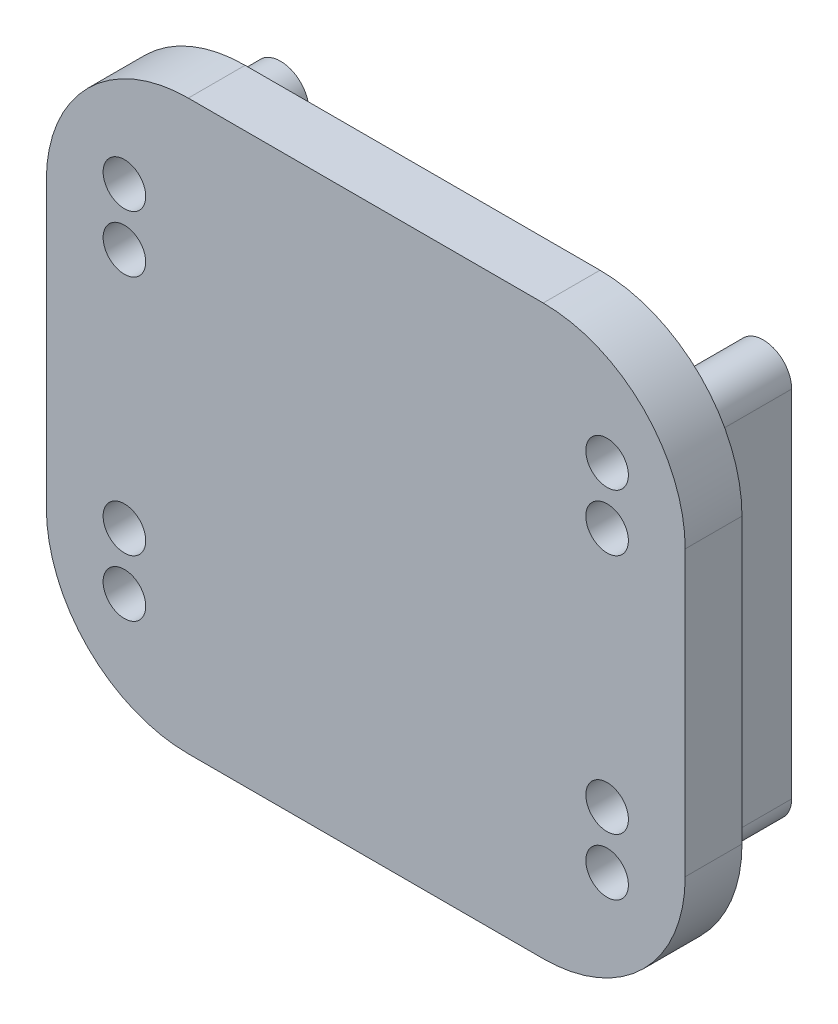
ISO-10303-21;
HEADER;
FILE_DESCRIPTION(('STEP AP214'),'2;1');
FILE_NAME('part.step','',(''),(''),'','','');
FILE_SCHEMA(('AUTOMOTIVE_DESIGN { 1 0 10303 214 1 1 1 1 }'));
ENDSEC;
DATA;
#1=APPLICATION_CONTEXT('core data for automotive mechanical design processes');
#2=APPLICATION_PROTOCOL_DEFINITION('international standard','automotive_design',2000,#1);
#3=PRODUCT_CONTEXT('',#1,'mechanical');
#4=PRODUCT('Part','Part','',(#3));
#5=PRODUCT_RELATED_PRODUCT_CATEGORY('part','',(#4));
#6=PRODUCT_DEFINITION_FORMATION('','',#4);
#7=PRODUCT_DEFINITION_CONTEXT('part definition',#1,'design');
#8=PRODUCT_DEFINITION('design','',#6,#7);
#9=PRODUCT_DEFINITION_SHAPE('','',#8);
#10=(LENGTH_UNIT() NAMED_UNIT(*) SI_UNIT(.MILLI.,.METRE.));
#11=(NAMED_UNIT(*) PLANE_ANGLE_UNIT() SI_UNIT($,.RADIAN.));
#12=(NAMED_UNIT(*) SI_UNIT($,.STERADIAN.) SOLID_ANGLE_UNIT());
#13=UNCERTAINTY_MEASURE_WITH_UNIT(LENGTH_MEASURE(1.E-05),#10,'distance_accuracy_value','');
#14=(GEOMETRIC_REPRESENTATION_CONTEXT(3) GLOBAL_UNCERTAINTY_ASSIGNED_CONTEXT((#13)) GLOBAL_UNIT_ASSIGNED_CONTEXT((#10,
#11,#12)) REPRESENTATION_CONTEXT('',''));
#15=CARTESIAN_POINT('',(0.,0.,0.));
#16=DIRECTION('',(0.,0.,1.));
#17=DIRECTION('',(1.,0.,0.));
#18=AXIS2_PLACEMENT_3D('',#15,#16,#17);
#19=CARTESIAN_POINT('',(0.,0.,7.));
#20=DIRECTION('',(0.,0.,-1.));
#21=DIRECTION('',(-1.,0.,0.));
#22=AXIS2_PLACEMENT_3D('',#19,#20,#21);
#23=PLANE('',#22);
#24=DIRECTION('',(0.,-1.,0.));
#25=VECTOR('',#24,1.);
#26=CARTESIAN_POINT('',(-4.,25.,7.));
#27=LINE('',#26,#25);
#28=CARTESIAN_POINT('',(-4.,25.,7.));
#29=VERTEX_POINT('',#28);
#30=CARTESIAN_POINT('',(-4.,0.,7.));
#31=VERTEX_POINT('',#30);
#32=EDGE_CURVE('E224',#29,#31,#27,.T.);
#33=ORIENTED_EDGE('',*,*,#32,.T.);
#34=CARTESIAN_POINT('',(-2.,0.,7.));
#35=DIRECTION('',(0.,0.,1.));
#36=DIRECTION('',(1.,0.,0.));
#37=AXIS2_PLACEMENT_3D('',#34,#35,#36);
#38=CIRCLE('',#37,2.);
#39=CARTESIAN_POINT('',(0.,0.,7.));
#40=VERTEX_POINT('',#39);
#41=EDGE_CURVE('E214',#31,#40,#38,.T.);
#42=ORIENTED_EDGE('',*,*,#41,.T.);
#43=DIRECTION('',(0.,1.,0.));
#44=VECTOR('',#43,1.);
#45=CARTESIAN_POINT('',(0.,0.,7.));
#46=LINE('',#45,#44);
#47=CARTESIAN_POINT('',(0.,25.,7.));
#48=VERTEX_POINT('',#47);
#49=EDGE_CURVE('E217',#40,#48,#46,.T.);
#50=ORIENTED_EDGE('',*,*,#49,.T.);
#51=CARTESIAN_POINT('',(-2.,25.,7.));
#52=DIRECTION('',(0.,0.,1.));
#53=DIRECTION('',(-1.,0.,0.));
#54=AXIS2_PLACEMENT_3D('',#51,#52,#53);
#55=CIRCLE('',#54,2.);
#56=EDGE_CURVE('E221',#48,#29,#55,.T.);
#57=ORIENTED_EDGE('',*,*,#56,.T.);
#58=EDGE_LOOP('',(#33,#42,#50,#57));
#59=FACE_BOUND('',#58,.T.);
#60=DIRECTION('',(0.,-1.,0.));
#61=VECTOR('',#60,1.);
#62=CARTESIAN_POINT('',(-7.5,-7.5,7.));
#63=LINE('',#62,#61);
#64=CARTESIAN_POINT('',(-7.5,22.5,7.));
#65=VERTEX_POINT('',#64);
#66=CARTESIAN_POINT('',(-7.5,2.5,7.));
#67=VERTEX_POINT('',#66);
#68=EDGE_CURVE('E210',#65,#67,#63,.T.);
#69=ORIENTED_EDGE('',*,*,#68,.F.);
#70=CARTESIAN_POINT('',(2.5,22.5,7.));
#71=DIRECTION('',(0.,0.,-1.));
#72=DIRECTION('',(-1.,0.,0.));
#73=AXIS2_PLACEMENT_3D('',#70,#71,#72);
#74=CIRCLE('',#73,10.);
#75=CARTESIAN_POINT('',(2.5,32.5,7.));
#76=VERTEX_POINT('',#75);
#77=EDGE_CURVE('E257',#65,#76,#74,.T.);
#78=ORIENTED_EDGE('',*,*,#77,.T.);
#79=DIRECTION('',(-1.,0.,0.));
#80=VECTOR('',#79,1.);
#81=CARTESIAN_POINT('',(-7.5,32.5,7.));
#82=LINE('',#81,#80);
#83=CARTESIAN_POINT('',(27.5,32.5,7.));
#84=VERTEX_POINT('',#83);
#85=EDGE_CURVE('E207',#84,#76,#82,.T.);
#86=ORIENTED_EDGE('',*,*,#85,.F.);
#87=CARTESIAN_POINT('',(27.5,22.5,7.));
#88=DIRECTION('',(0.,0.,-1.));
#89=DIRECTION('',(-1.,0.,0.));
#90=AXIS2_PLACEMENT_3D('',#87,#88,#89);
#91=CIRCLE('',#90,10.);
#92=CARTESIAN_POINT('',(37.5,22.5,7.));
#93=VERTEX_POINT('',#92);
#94=EDGE_CURVE('E255',#84,#93,#91,.T.);
#95=ORIENTED_EDGE('',*,*,#94,.T.);
#96=DIRECTION('',(0.,1.,0.));
#97=VECTOR('',#96,1.);
#98=CARTESIAN_POINT('',(37.5,-7.5,7.));
#99=LINE('',#98,#97);
#100=CARTESIAN_POINT('',(37.5,2.5,7.));
#101=VERTEX_POINT('',#100);
#102=EDGE_CURVE('E168',#101,#93,#99,.T.);
#103=ORIENTED_EDGE('',*,*,#102,.F.);
#104=CARTESIAN_POINT('',(27.5,2.5,7.));
#105=DIRECTION('',(0.,0.,-1.));
#106=DIRECTION('',(-1.,0.,0.));
#107=AXIS2_PLACEMENT_3D('',#104,#105,#106);
#108=CIRCLE('',#107,10.);
#109=CARTESIAN_POINT('',(27.5,-7.5,7.));
#110=VERTEX_POINT('',#109);
#111=EDGE_CURVE('E251',#101,#110,#108,.T.);
#112=ORIENTED_EDGE('',*,*,#111,.T.);
#113=DIRECTION('',(1.,0.,0.));
#114=VECTOR('',#113,1.);
#115=CARTESIAN_POINT('',(-7.5,-7.5,7.));
#116=LINE('',#115,#114);
#117=CARTESIAN_POINT('',(2.5,-7.5,7.));
#118=VERTEX_POINT('',#117);
#119=EDGE_CURVE('E197',#118,#110,#116,.T.);
#120=ORIENTED_EDGE('',*,*,#119,.F.);
#121=CARTESIAN_POINT('',(2.5,2.5,7.));
#122=DIRECTION('',(0.,0.,-1.));
#123=DIRECTION('',(-1.,0.,0.));
#124=AXIS2_PLACEMENT_3D('',#121,#122,#123);
#125=CIRCLE('',#124,10.);
#126=EDGE_CURVE('E253',#118,#67,#125,.T.);
#127=ORIENTED_EDGE('',*,*,#126,.T.);
#128=EDGE_LOOP('',(#69,#78,#86,#95,#103,#112,#120,#127));
#129=FACE_BOUND('',#128,.T.);
#130=DIRECTION('',(0.,-1.,0.));
#131=VECTOR('',#130,1.);
#132=CARTESIAN_POINT('',(30.,0.,7.));
#133=LINE('',#132,#131);
#134=CARTESIAN_POINT('',(30.,25.,7.));
#135=VERTEX_POINT('',#134);
#136=CARTESIAN_POINT('',(30.,0.,7.));
#137=VERTEX_POINT('',#136);
#138=EDGE_CURVE('E172',#135,#137,#133,.T.);
#139=ORIENTED_EDGE('',*,*,#138,.T.);
#140=CARTESIAN_POINT('',(32.,0.,7.));
#141=DIRECTION('',(0.,0.,1.));
#142=DIRECTION('',(-1.,0.,0.));
#143=AXIS2_PLACEMENT_3D('',#140,#141,#142);
#144=CIRCLE('',#143,2.00000000000001);
#145=CARTESIAN_POINT('',(34.,0.,7.));
#146=VERTEX_POINT('',#145);
#147=EDGE_CURVE('E160',#137,#146,#144,.T.);
#148=ORIENTED_EDGE('',*,*,#147,.T.);
#149=DIRECTION('',(0.,1.,0.));
#150=VECTOR('',#149,1.);
#151=CARTESIAN_POINT('',(34.,25.,7.));
#152=LINE('',#151,#150);
#153=CARTESIAN_POINT('',(34.,25.,7.));
#154=VERTEX_POINT('',#153);
#155=EDGE_CURVE('E148',#146,#154,#152,.T.);
#156=ORIENTED_EDGE('',*,*,#155,.T.);
#157=CARTESIAN_POINT('',(32.,25.,7.));
#158=DIRECTION('',(0.,0.,1.));
#159=DIRECTION('',(1.,0.,0.));
#160=AXIS2_PLACEMENT_3D('',#157,#158,#159);
#161=CIRCLE('',#160,2.);
#162=EDGE_CURVE('E159',#154,#135,#161,.T.);
#163=ORIENTED_EDGE('',*,*,#162,.T.);
#164=EDGE_LOOP('',(#139,#148,#156,#163));
#165=FACE_BOUND('',#164,.T.);
#166=ADVANCED_FACE('F32',(#59,#129,#165),#23,.T.);
#167=CARTESIAN_POINT('',(-2.,0.,7.));
#168=DIRECTION('',(0.,0.,-1.));
#169=DIRECTION('',(-1.,0.,0.));
#170=AXIS2_PLACEMENT_3D('',#167,#168,#169);
#171=CYLINDRICAL_SURFACE('',#170,2.);
#172=CARTESIAN_POINT('',(-2.,0.,0.));
#173=DIRECTION('',(0.,0.,1.));
#174=DIRECTION('',(1.,0.,0.));
#175=AXIS2_PLACEMENT_3D('',#172,#173,#174);
#176=CIRCLE('',#175,2.);
#177=CARTESIAN_POINT('',(-4.,0.,0.));
#178=VERTEX_POINT('',#177);
#179=CARTESIAN_POINT('',(0.,0.,0.));
#180=VERTEX_POINT('',#179);
#181=EDGE_CURVE('E204',#178,#180,#176,.T.);
#182=ORIENTED_EDGE('',*,*,#181,.T.);
#183=DIRECTION('',(0.,0.,-1.));
#184=VECTOR('',#183,1.);
#185=CARTESIAN_POINT('',(0.,0.,7.));
#186=LINE('',#185,#184);
#187=EDGE_CURVE('E243',#40,#180,#186,.T.);
#188=ORIENTED_EDGE('',*,*,#187,.F.);
#189=ORIENTED_EDGE('',*,*,#41,.F.);
#190=DIRECTION('',(0.,0.,-1.));
#191=VECTOR('',#190,1.);
#192=CARTESIAN_POINT('',(-4.,0.,7.));
#193=LINE('',#192,#191);
#194=EDGE_CURVE('E227',#31,#178,#193,.T.);
#195=ORIENTED_EDGE('',*,*,#194,.T.);
#196=EDGE_LOOP('',(#182,#188,#189,#195));
#197=FACE_BOUND('',#196,.T.);
#198=ADVANCED_FACE('F306',(#197),#171,.T.);
#199=CARTESIAN_POINT('',(0.,0.,7.));
#200=DIRECTION('',(-1.,0.,0.));
#201=DIRECTION('',(0.,0.,1.));
#202=AXIS2_PLACEMENT_3D('',#199,#200,#201);
#203=PLANE('',#202);
#204=DIRECTION('',(0.,1.,0.));
#205=VECTOR('',#204,1.);
#206=CARTESIAN_POINT('',(0.,0.,0.));
#207=LINE('',#206,#205);
#208=CARTESIAN_POINT('',(0.,25.,0.));
#209=VERTEX_POINT('',#208);
#210=EDGE_CURVE('E230',#180,#209,#207,.T.);
#211=ORIENTED_EDGE('',*,*,#210,.T.);
#212=DIRECTION('',(0.,0.,-1.));
#213=VECTOR('',#212,1.);
#214=CARTESIAN_POINT('',(0.,25.,7.));
#215=LINE('',#214,#213);
#216=EDGE_CURVE('E240',#48,#209,#215,.T.);
#217=ORIENTED_EDGE('',*,*,#216,.F.);
#218=ORIENTED_EDGE('',*,*,#49,.F.);
#219=ORIENTED_EDGE('',*,*,#187,.T.);
#220=EDGE_LOOP('',(#211,#217,#218,#219));
#221=FACE_BOUND('',#220,.T.);
#222=ADVANCED_FACE('F312',(#221),#203,.F.);
#223=CARTESIAN_POINT('',(-2.,25.,7.));
#224=DIRECTION('',(0.,0.,-1.));
#225=DIRECTION('',(-1.,0.,0.));
#226=AXIS2_PLACEMENT_3D('',#223,#224,#225);
#227=CYLINDRICAL_SURFACE('',#226,2.);
#228=CARTESIAN_POINT('',(-2.,25.,0.));
#229=DIRECTION('',(0.,0.,1.));
#230=DIRECTION('',(-1.,0.,0.));
#231=AXIS2_PLACEMENT_3D('',#228,#229,#230);
#232=CIRCLE('',#231,2.);
#233=CARTESIAN_POINT('',(-4.,25.,0.));
#234=VERTEX_POINT('',#233);
#235=EDGE_CURVE('E232',#209,#234,#232,.T.);
#236=ORIENTED_EDGE('',*,*,#235,.T.);
#237=DIRECTION('',(0.,0.,-1.));
#238=VECTOR('',#237,1.);
#239=CARTESIAN_POINT('',(-4.,25.,7.));
#240=LINE('',#239,#238);
#241=EDGE_CURVE('E237',#29,#234,#240,.T.);
#242=ORIENTED_EDGE('',*,*,#241,.F.);
#243=ORIENTED_EDGE('',*,*,#56,.F.);
#244=ORIENTED_EDGE('',*,*,#216,.T.);
#245=EDGE_LOOP('',(#236,#242,#243,#244));
#246=FACE_BOUND('',#245,.T.);
#247=ADVANCED_FACE('F341',(#246),#227,.T.);
#248=CARTESIAN_POINT('',(-4.,25.,7.));
#249=DIRECTION('',(1.,0.,0.));
#250=DIRECTION('',(0.,1.,0.));
#251=AXIS2_PLACEMENT_3D('',#248,#249,#250);
#252=PLANE('',#251);
#253=DIRECTION('',(0.,-1.,0.));
#254=VECTOR('',#253,1.);
#255=CARTESIAN_POINT('',(-4.,25.,0.));
#256=LINE('',#255,#254);
#257=EDGE_CURVE('E218',#234,#178,#256,.T.);
#258=ORIENTED_EDGE('',*,*,#257,.T.);
#259=ORIENTED_EDGE('',*,*,#194,.F.);
#260=ORIENTED_EDGE('',*,*,#32,.F.);
#261=ORIENTED_EDGE('',*,*,#241,.T.);
#262=EDGE_LOOP('',(#258,#259,#260,#261));
#263=FACE_BOUND('',#262,.T.);
#264=ADVANCED_FACE('F337',(#263),#252,.F.);
#265=CARTESIAN_POINT('',(-2.,0.,0.));
#266=DIRECTION('',(0.,0.,1.));
#267=DIRECTION('',(1.,0.,0.));
#268=AXIS2_PLACEMENT_3D('',#265,#266,#267);
#269=PLANE('',#268);
#270=CARTESIAN_POINT('',(-2.,4.,0.));
#271=DIRECTION('',(0.,0.,-1.));
#272=DIRECTION('',(-1.,0.,0.));
#273=AXIS2_PLACEMENT_3D('',#270,#271,#272);
#274=CIRCLE('',#273,1.5);
#275=CARTESIAN_POINT('',(-3.5,4.,0.));
#276=VERTEX_POINT('',#275);
#277=EDGE_CURVE('E409',#276,#276,#274,.T.);
#278=ORIENTED_EDGE('',*,*,#277,.F.);
#279=EDGE_LOOP('',(#278));
#280=FACE_BOUND('',#279,.T.);
#281=CARTESIAN_POINT('',(-2.,0.,0.));
#282=DIRECTION('',(0.,0.,-1.));
#283=DIRECTION('',(-1.,0.,0.));
#284=AXIS2_PLACEMENT_3D('',#281,#282,#283);
#285=CIRCLE('',#284,1.5);
#286=CARTESIAN_POINT('',(-3.5,0.,0.));
#287=VERTEX_POINT('',#286);
#288=EDGE_CURVE('E406',#287,#287,#285,.T.);
#289=ORIENTED_EDGE('',*,*,#288,.F.);
#290=EDGE_LOOP('',(#289));
#291=FACE_BOUND('',#290,.T.);
#292=CARTESIAN_POINT('',(-2.,21.,0.));
#293=DIRECTION('',(0.,0.,-1.));
#294=DIRECTION('',(1.,0.,0.));
#295=AXIS2_PLACEMENT_3D('',#292,#293,#294);
#296=CIRCLE('',#295,1.5);
#297=CARTESIAN_POINT('',(-0.500000000000005,21.,0.));
#298=VERTEX_POINT('',#297);
#299=EDGE_CURVE('E420',#298,#298,#296,.T.);
#300=ORIENTED_EDGE('',*,*,#299,.F.);
#301=EDGE_LOOP('',(#300));
#302=FACE_BOUND('',#301,.T.);
#303=CARTESIAN_POINT('',(-2.,25.,0.));
#304=DIRECTION('',(0.,0.,-1.));
#305=DIRECTION('',(1.,0.,0.));
#306=AXIS2_PLACEMENT_3D('',#303,#304,#305);
#307=CIRCLE('',#306,1.5);
#308=CARTESIAN_POINT('',(-0.500000000000006,25.,0.));
#309=VERTEX_POINT('',#308);
#310=EDGE_CURVE('E417',#309,#309,#307,.T.);
#311=ORIENTED_EDGE('',*,*,#310,.F.);
#312=EDGE_LOOP('',(#311));
#313=FACE_BOUND('',#312,.T.);
#314=ORIENTED_EDGE('',*,*,#181,.F.);
#315=ORIENTED_EDGE('',*,*,#257,.F.);
#316=ORIENTED_EDGE('',*,*,#235,.F.);
#317=ORIENTED_EDGE('',*,*,#210,.F.);
#318=EDGE_LOOP('',(#314,#315,#316,#317));
#319=FACE_BOUND('',#318,.T.);
#320=ADVANCED_FACE('F333',(#280,#291,#302,#313,#319),#269,.F.);
#321=CARTESIAN_POINT('',(37.5,-7.5,11.));
#322=DIRECTION('',(-1.,0.,0.));
#323=DIRECTION('',(0.,0.,1.));
#324=AXIS2_PLACEMENT_3D('',#321,#322,#323);
#325=PLANE('',#324);
#326=ORIENTED_EDGE('',*,*,#102,.T.);
#327=DIRECTION('',(0.,0.,-1.));
#328=VECTOR('',#327,1.);
#329=CARTESIAN_POINT('',(37.5,22.5,11.));
#330=LINE('',#329,#328);
#331=CARTESIAN_POINT('',(37.5,22.5,11.));
#332=VERTEX_POINT('',#331);
#333=EDGE_CURVE('E274',#93,#332,#330,.F.);
#334=ORIENTED_EDGE('',*,*,#333,.T.);
#335=DIRECTION('',(0.,1.,0.));
#336=VECTOR('',#335,1.);
#337=CARTESIAN_POINT('',(37.5,-7.5,11.));
#338=LINE('',#337,#336);
#339=CARTESIAN_POINT('',(37.5,2.5,11.));
#340=VERTEX_POINT('',#339);
#341=EDGE_CURVE('E193',#340,#332,#338,.T.);
#342=ORIENTED_EDGE('',*,*,#341,.F.);
#343=DIRECTION('',(0.,0.,-1.));
#344=VECTOR('',#343,1.);
#345=CARTESIAN_POINT('',(37.5,2.5,11.));
#346=LINE('',#345,#344);
#347=EDGE_CURVE('E271',#340,#101,#346,.T.);
#348=ORIENTED_EDGE('',*,*,#347,.T.);
#349=EDGE_LOOP('',(#326,#334,#342,#348));
#350=FACE_BOUND('',#349,.T.);
#351=ADVANCED_FACE('F329',(#350),#325,.F.);
#352=CARTESIAN_POINT('',(-7.5,32.5,11.));
#353=DIRECTION('',(0.,-1.,0.));
#354=DIRECTION('',(0.,0.,-1.));
#355=AXIS2_PLACEMENT_3D('',#352,#353,#354);
#356=PLANE('',#355);
#357=ORIENTED_EDGE('',*,*,#85,.T.);
#358=DIRECTION('',(0.,0.,-1.));
#359=VECTOR('',#358,1.);
#360=CARTESIAN_POINT('',(2.5,32.5,11.));
#361=LINE('',#360,#359);
#362=CARTESIAN_POINT('',(2.5,32.5,11.));
#363=VERTEX_POINT('',#362);
#364=EDGE_CURVE('E262',#76,#363,#361,.F.);
#365=ORIENTED_EDGE('',*,*,#364,.T.);
#366=DIRECTION('',(-1.,0.,0.));
#367=VECTOR('',#366,1.);
#368=CARTESIAN_POINT('',(-7.5,32.5,11.));
#369=LINE('',#368,#367);
#370=CARTESIAN_POINT('',(27.5,32.5,11.));
#371=VERTEX_POINT('',#370);
#372=EDGE_CURVE('E196',#371,#363,#369,.T.);
#373=ORIENTED_EDGE('',*,*,#372,.F.);
#374=DIRECTION('',(0.,0.,-1.));
#375=VECTOR('',#374,1.);
#376=CARTESIAN_POINT('',(27.5,32.5,11.));
#377=LINE('',#376,#375);
#378=EDGE_CURVE('E259',#371,#84,#377,.T.);
#379=ORIENTED_EDGE('',*,*,#378,.T.);
#380=EDGE_LOOP('',(#357,#365,#373,#379));
#381=FACE_BOUND('',#380,.T.);
#382=ADVANCED_FACE('F325',(#381),#356,.F.);
#383=CARTESIAN_POINT('',(-7.5,-7.5,11.));
#384=DIRECTION('',(1.,0.,0.));
#385=DIRECTION('',(0.,0.,-1.));
#386=AXIS2_PLACEMENT_3D('',#383,#384,#385);
#387=PLANE('',#386);
#388=DIRECTION('',(0.,-1.,0.));
#389=VECTOR('',#388,1.);
#390=CARTESIAN_POINT('',(-7.5,-7.5,11.));
#391=LINE('',#390,#389);
#392=CARTESIAN_POINT('',(-7.5,22.5,11.));
#393=VERTEX_POINT('',#392);
#394=CARTESIAN_POINT('',(-7.5,2.5,11.));
#395=VERTEX_POINT('',#394);
#396=EDGE_CURVE('E200',#393,#395,#391,.T.);
#397=ORIENTED_EDGE('',*,*,#396,.F.);
#398=DIRECTION('',(0.,0.,-1.));
#399=VECTOR('',#398,1.);
#400=CARTESIAN_POINT('',(-7.5,22.5,11.));
#401=LINE('',#400,#399);
#402=EDGE_CURVE('E248',#393,#65,#401,.T.);
#403=ORIENTED_EDGE('',*,*,#402,.T.);
#404=ORIENTED_EDGE('',*,*,#68,.T.);
#405=DIRECTION('',(0.,0.,-1.));
#406=VECTOR('',#405,1.);
#407=CARTESIAN_POINT('',(-7.5,2.5,11.));
#408=LINE('',#407,#406);
#409=EDGE_CURVE('E246',#67,#395,#408,.F.);
#410=ORIENTED_EDGE('',*,*,#409,.T.);
#411=EDGE_LOOP('',(#397,#403,#404,#410));
#412=FACE_BOUND('',#411,.T.);
#413=ADVANCED_FACE('F322',(#412),#387,.F.);
#414=CARTESIAN_POINT('',(-7.5,-7.5,11.));
#415=DIRECTION('',(0.,1.,0.));
#416=DIRECTION('',(0.,0.,1.));
#417=AXIS2_PLACEMENT_3D('',#414,#415,#416);
#418=PLANE('',#417);
#419=DIRECTION('',(1.,0.,0.));
#420=VECTOR('',#419,1.);
#421=CARTESIAN_POINT('',(-7.5,-7.5,11.));
#422=LINE('',#421,#420);
#423=CARTESIAN_POINT('',(2.5,-7.5,11.));
#424=VERTEX_POINT('',#423);
#425=CARTESIAN_POINT('',(27.5,-7.5,11.));
#426=VERTEX_POINT('',#425);
#427=EDGE_CURVE('E202',#424,#426,#422,.T.);
#428=ORIENTED_EDGE('',*,*,#427,.F.);
#429=DIRECTION('',(0.,0.,-1.));
#430=VECTOR('',#429,1.);
#431=CARTESIAN_POINT('',(2.5,-7.5,11.));
#432=LINE('',#431,#430);
#433=EDGE_CURVE('E11',#424,#118,#432,.T.);
#434=ORIENTED_EDGE('',*,*,#433,.T.);
#435=ORIENTED_EDGE('',*,*,#119,.T.);
#436=DIRECTION('',(0.,0.,-1.));
#437=VECTOR('',#436,1.);
#438=CARTESIAN_POINT('',(27.5,-7.5,11.));
#439=LINE('',#438,#437);
#440=EDGE_CURVE('E41',#110,#426,#439,.F.);
#441=ORIENTED_EDGE('',*,*,#440,.T.);
#442=EDGE_LOOP('',(#428,#434,#435,#441));
#443=FACE_BOUND('',#442,.T.);
#444=ADVANCED_FACE('F319',(#443),#418,.F.);
#445=CARTESIAN_POINT('',(0.,0.,11.));
#446=DIRECTION('',(0.,0.,-1.));
#447=DIRECTION('',(-1.,0.,0.));
#448=AXIS2_PLACEMENT_3D('',#445,#446,#447);
#449=PLANE('',#448);
#450=CARTESIAN_POINT('',(32.,25.,11.));
#451=DIRECTION('',(0.,0.,-1.));
#452=DIRECTION('',(-1.,0.,0.));
#453=AXIS2_PLACEMENT_3D('',#450,#451,#452);
#454=CIRCLE('',#453,1.50000000000001);
#455=CARTESIAN_POINT('',(30.5,25.,11.));
#456=VERTEX_POINT('',#455);
#457=EDGE_CURVE('E178',#456,#456,#454,.T.);
#458=ORIENTED_EDGE('',*,*,#457,.T.);
#459=EDGE_LOOP('',(#458));
#460=FACE_BOUND('',#459,.T.);
#461=CARTESIAN_POINT('',(-2.,4.,11.));
#462=DIRECTION('',(0.,0.,-1.));
#463=DIRECTION('',(-1.,0.,0.));
#464=AXIS2_PLACEMENT_3D('',#461,#462,#463);
#465=CIRCLE('',#464,1.5);
#466=CARTESIAN_POINT('',(-3.5,4.,11.));
#467=VERTEX_POINT('',#466);
#468=EDGE_CURVE('E36',#467,#467,#465,.T.);
#469=ORIENTED_EDGE('',*,*,#468,.T.);
#470=EDGE_LOOP('',(#469));
#471=FACE_BOUND('',#470,.T.);
#472=CARTESIAN_POINT('',(-2.,0.,11.));
#473=DIRECTION('',(0.,0.,-1.));
#474=DIRECTION('',(-1.,0.,0.));
#475=AXIS2_PLACEMENT_3D('',#472,#473,#474);
#476=CIRCLE('',#475,1.5);
#477=CARTESIAN_POINT('',(-3.5,0.,11.));
#478=VERTEX_POINT('',#477);
#479=EDGE_CURVE('E282',#478,#478,#476,.T.);
#480=ORIENTED_EDGE('',*,*,#479,.T.);
#481=EDGE_LOOP('',(#480));
#482=FACE_BOUND('',#481,.T.);
#483=CARTESIAN_POINT('',(32.,4.,11.));
#484=DIRECTION('',(0.,0.,-1.));
#485=DIRECTION('',(-1.,0.,0.));
#486=AXIS2_PLACEMENT_3D('',#483,#484,#485);
#487=CIRCLE('',#486,1.5);
#488=CARTESIAN_POINT('',(30.5,4.,11.));
#489=VERTEX_POINT('',#488);
#490=EDGE_CURVE('E391',#489,#489,#487,.T.);
#491=ORIENTED_EDGE('',*,*,#490,.T.);
#492=EDGE_LOOP('',(#491));
#493=FACE_BOUND('',#492,.T.);
#494=CARTESIAN_POINT('',(-2.,21.,11.));
#495=DIRECTION('',(0.,0.,-1.));
#496=DIRECTION('',(-1.,0.,0.));
#497=AXIS2_PLACEMENT_3D('',#494,#495,#496);
#498=CIRCLE('',#497,1.5);
#499=CARTESIAN_POINT('',(-3.5,21.,11.));
#500=VERTEX_POINT('',#499);
#501=EDGE_CURVE('E280',#500,#500,#498,.T.);
#502=ORIENTED_EDGE('',*,*,#501,.T.);
#503=EDGE_LOOP('',(#502));
#504=FACE_BOUND('',#503,.T.);
#505=CARTESIAN_POINT('',(-2.,25.,11.));
#506=DIRECTION('',(0.,0.,-1.));
#507=DIRECTION('',(-1.,0.,0.));
#508=AXIS2_PLACEMENT_3D('',#505,#506,#507);
#509=CIRCLE('',#508,1.5);
#510=CARTESIAN_POINT('',(-3.5,25.,11.));
#511=VERTEX_POINT('',#510);
#512=EDGE_CURVE('E277',#511,#511,#509,.T.);
#513=ORIENTED_EDGE('',*,*,#512,.T.);
#514=EDGE_LOOP('',(#513));
#515=FACE_BOUND('',#514,.T.);
#516=CARTESIAN_POINT('',(32.,21.,11.));
#517=DIRECTION('',(0.,0.,-1.));
#518=DIRECTION('',(-1.,0.,0.));
#519=AXIS2_PLACEMENT_3D('',#516,#517,#518);
#520=CIRCLE('',#519,1.50000000000001);
#521=CARTESIAN_POINT('',(30.5,21.,11.));
#522=VERTEX_POINT('',#521);
#523=EDGE_CURVE('E393',#522,#522,#520,.T.);
#524=ORIENTED_EDGE('',*,*,#523,.T.);
#525=EDGE_LOOP('',(#524));
#526=FACE_BOUND('',#525,.T.);
#527=CARTESIAN_POINT('',(32.,0.,11.));
#528=DIRECTION('',(0.,0.,-1.));
#529=DIRECTION('',(-1.,0.,0.));
#530=AXIS2_PLACEMENT_3D('',#527,#528,#529);
#531=CIRCLE('',#530,1.5);
#532=CARTESIAN_POINT('',(30.5,0.,11.));
#533=VERTEX_POINT('',#532);
#534=EDGE_CURVE('E397',#533,#533,#531,.T.);
#535=ORIENTED_EDGE('',*,*,#534,.T.);
#536=EDGE_LOOP('',(#535));
#537=FACE_BOUND('',#536,.T.);
#538=ORIENTED_EDGE('',*,*,#372,.T.);
#539=CARTESIAN_POINT('',(2.5,22.5,11.));
#540=DIRECTION('',(0.,0.,-1.));
#541=DIRECTION('',(-1.,0.,0.));
#542=AXIS2_PLACEMENT_3D('',#539,#540,#541);
#543=CIRCLE('',#542,10.);
#544=EDGE_CURVE('E269',#363,#393,#543,.F.);
#545=ORIENTED_EDGE('',*,*,#544,.T.);
#546=ORIENTED_EDGE('',*,*,#396,.T.);
#547=CARTESIAN_POINT('',(2.5,2.5,11.));
#548=DIRECTION('',(0.,0.,-1.));
#549=DIRECTION('',(-1.,0.,0.));
#550=AXIS2_PLACEMENT_3D('',#547,#548,#549);
#551=CIRCLE('',#550,10.);
#552=EDGE_CURVE('E55',#395,#424,#551,.F.);
#553=ORIENTED_EDGE('',*,*,#552,.T.);
#554=ORIENTED_EDGE('',*,*,#427,.T.);
#555=CARTESIAN_POINT('',(27.5,2.5,11.));
#556=DIRECTION('',(0.,0.,-1.));
#557=DIRECTION('',(-1.,0.,0.));
#558=AXIS2_PLACEMENT_3D('',#555,#556,#557);
#559=CIRCLE('',#558,10.);
#560=EDGE_CURVE('E264',#426,#340,#559,.F.);
#561=ORIENTED_EDGE('',*,*,#560,.T.);
#562=ORIENTED_EDGE('',*,*,#341,.T.);
#563=CARTESIAN_POINT('',(27.5,22.5,11.));
#564=DIRECTION('',(0.,0.,-1.));
#565=DIRECTION('',(-1.,0.,0.));
#566=AXIS2_PLACEMENT_3D('',#563,#564,#565);
#567=CIRCLE('',#566,10.);
#568=EDGE_CURVE('E267',#332,#371,#567,.F.);
#569=ORIENTED_EDGE('',*,*,#568,.T.);
#570=EDGE_LOOP('',(#538,#545,#546,#553,#554,#561,#562,#569));
#571=FACE_BOUND('',#570,.T.);
#572=ADVANCED_FACE('F289',(#460,#471,#482,#493,#504,#515,#526,#537,#571),#449,.F.);
#573=CARTESIAN_POINT('',(32.,0.,7.));
#574=DIRECTION('',(0.,0.,-1.));
#575=DIRECTION('',(-1.,0.,0.));
#576=AXIS2_PLACEMENT_3D('',#573,#574,#575);
#577=CYLINDRICAL_SURFACE('',#576,2.00000000000001);
#578=CARTESIAN_POINT('',(32.,0.,0.));
#579=DIRECTION('',(0.,0.,1.));
#580=DIRECTION('',(-1.,0.,0.));
#581=AXIS2_PLACEMENT_3D('',#578,#579,#580);
#582=CIRCLE('',#581,2.00000000000001);
#583=CARTESIAN_POINT('',(30.,0.,0.));
#584=VERTEX_POINT('',#583);
#585=CARTESIAN_POINT('',(34.,0.,0.));
#586=VERTEX_POINT('',#585);
#587=EDGE_CURVE('E167',#584,#586,#582,.T.);
#588=ORIENTED_EDGE('',*,*,#587,.T.);
#589=DIRECTION('',(0.,0.,-1.));
#590=VECTOR('',#589,1.);
#591=CARTESIAN_POINT('',(34.,0.,7.));
#592=LINE('',#591,#590);
#593=EDGE_CURVE('E151',#146,#586,#592,.T.);
#594=ORIENTED_EDGE('',*,*,#593,.F.);
#595=ORIENTED_EDGE('',*,*,#147,.F.);
#596=DIRECTION('',(0.,0.,-1.));
#597=VECTOR('',#596,1.);
#598=CARTESIAN_POINT('',(30.,0.,7.));
#599=LINE('',#598,#597);
#600=EDGE_CURVE('E183',#137,#584,#599,.T.);
#601=ORIENTED_EDGE('',*,*,#600,.T.);
#602=EDGE_LOOP('',(#588,#594,#595,#601));
#603=FACE_BOUND('',#602,.T.);
#604=ADVANCED_FACE('F163',(#603),#577,.T.);
#605=CARTESIAN_POINT('',(34.,25.,7.));
#606=DIRECTION('',(-1.,0.,0.));
#607=DIRECTION('',(0.,-1.,0.));
#608=AXIS2_PLACEMENT_3D('',#605,#606,#607);
#609=PLANE('',#608);
#610=DIRECTION('',(0.,1.,0.));
#611=VECTOR('',#610,1.);
#612=CARTESIAN_POINT('',(34.,25.,0.));
#613=LINE('',#612,#611);
#614=CARTESIAN_POINT('',(34.,25.,0.));
#615=VERTEX_POINT('',#614);
#616=EDGE_CURVE('E185',#586,#615,#613,.T.);
#617=ORIENTED_EDGE('',*,*,#616,.T.);
#618=DIRECTION('',(0.,0.,-1.));
#619=VECTOR('',#618,1.);
#620=CARTESIAN_POINT('',(34.,25.,7.));
#621=LINE('',#620,#619);
#622=EDGE_CURVE('E154',#154,#615,#621,.T.);
#623=ORIENTED_EDGE('',*,*,#622,.F.);
#624=ORIENTED_EDGE('',*,*,#155,.F.);
#625=ORIENTED_EDGE('',*,*,#593,.T.);
#626=EDGE_LOOP('',(#617,#623,#624,#625));
#627=FACE_BOUND('',#626,.T.);
#628=ADVANCED_FACE('F150',(#627),#609,.F.);
#629=CARTESIAN_POINT('',(32.,25.,7.));
#630=DIRECTION('',(0.,0.,-1.));
#631=DIRECTION('',(-1.,0.,0.));
#632=AXIS2_PLACEMENT_3D('',#629,#630,#631);
#633=CYLINDRICAL_SURFACE('',#632,2.);
#634=CARTESIAN_POINT('',(32.,25.,0.));
#635=DIRECTION('',(0.,0.,1.));
#636=DIRECTION('',(1.,0.,0.));
#637=AXIS2_PLACEMENT_3D('',#634,#635,#636);
#638=CIRCLE('',#637,2.);
#639=CARTESIAN_POINT('',(30.,25.,0.));
#640=VERTEX_POINT('',#639);
#641=EDGE_CURVE('E175',#615,#640,#638,.T.);
#642=ORIENTED_EDGE('',*,*,#641,.T.);
#643=DIRECTION('',(0.,0.,-1.));
#644=VECTOR('',#643,1.);
#645=CARTESIAN_POINT('',(30.,25.,7.));
#646=LINE('',#645,#644);
#647=EDGE_CURVE('E189',#135,#640,#646,.T.);
#648=ORIENTED_EDGE('',*,*,#647,.F.);
#649=ORIENTED_EDGE('',*,*,#162,.F.);
#650=ORIENTED_EDGE('',*,*,#622,.T.);
#651=EDGE_LOOP('',(#642,#648,#649,#650));
#652=FACE_BOUND('',#651,.T.);
#653=ADVANCED_FACE('F467',(#652),#633,.T.);
#654=CARTESIAN_POINT('',(30.,0.,7.));
#655=DIRECTION('',(1.,0.,0.));
#656=DIRECTION('',(0.,0.,-1.));
#657=AXIS2_PLACEMENT_3D('',#654,#655,#656);
#658=PLANE('',#657);
#659=DIRECTION('',(0.,-1.,0.));
#660=VECTOR('',#659,1.);
#661=CARTESIAN_POINT('',(30.,0.,0.));
#662=LINE('',#661,#660);
#663=EDGE_CURVE('E173',#640,#584,#662,.T.);
#664=ORIENTED_EDGE('',*,*,#663,.T.);
#665=ORIENTED_EDGE('',*,*,#600,.F.);
#666=ORIENTED_EDGE('',*,*,#138,.F.);
#667=ORIENTED_EDGE('',*,*,#647,.T.);
#668=EDGE_LOOP('',(#664,#665,#666,#667));
#669=FACE_BOUND('',#668,.T.);
#670=ADVANCED_FACE('F463',(#669),#658,.F.);
#671=CARTESIAN_POINT('',(32.,0.,0.));
#672=DIRECTION('',(0.,0.,-1.));
#673=DIRECTION('',(-1.,0.,0.));
#674=AXIS2_PLACEMENT_3D('',#671,#672,#673);
#675=PLANE('',#674);
#676=CARTESIAN_POINT('',(32.,25.,0.));
#677=DIRECTION('',(0.,0.,-1.));
#678=DIRECTION('',(1.,0.,0.));
#679=AXIS2_PLACEMENT_3D('',#676,#677,#678);
#680=CIRCLE('',#679,1.50000000000001);
#681=CARTESIAN_POINT('',(33.5,25.,0.));
#682=VERTEX_POINT('',#681);
#683=EDGE_CURVE('E412',#682,#682,#680,.T.);
#684=ORIENTED_EDGE('',*,*,#683,.F.);
#685=EDGE_LOOP('',(#684));
#686=FACE_BOUND('',#685,.T.);
#687=CARTESIAN_POINT('',(32.,4.,0.));
#688=DIRECTION('',(0.,0.,-1.));
#689=DIRECTION('',(-1.,0.,0.));
#690=AXIS2_PLACEMENT_3D('',#687,#688,#689);
#691=CIRCLE('',#690,1.5);
#692=CARTESIAN_POINT('',(30.5,4.,0.));
#693=VERTEX_POINT('',#692);
#694=EDGE_CURVE('E405',#693,#693,#691,.T.);
#695=ORIENTED_EDGE('',*,*,#694,.F.);
#696=EDGE_LOOP('',(#695));
#697=FACE_BOUND('',#696,.T.);
#698=CARTESIAN_POINT('',(32.,21.,0.));
#699=DIRECTION('',(0.,0.,-1.));
#700=DIRECTION('',(1.,0.,0.));
#701=AXIS2_PLACEMENT_3D('',#698,#699,#700);
#702=CIRCLE('',#701,1.50000000000001);
#703=CARTESIAN_POINT('',(33.5,21.,0.));
#704=VERTEX_POINT('',#703);
#705=EDGE_CURVE('E415',#704,#704,#702,.T.);
#706=ORIENTED_EDGE('',*,*,#705,.F.);
#707=EDGE_LOOP('',(#706));
#708=FACE_BOUND('',#707,.T.);
#709=CARTESIAN_POINT('',(32.,0.,0.));
#710=DIRECTION('',(0.,0.,-1.));
#711=DIRECTION('',(-1.,0.,0.));
#712=AXIS2_PLACEMENT_3D('',#709,#710,#711);
#713=CIRCLE('',#712,1.5);
#714=CARTESIAN_POINT('',(30.5,0.,0.));
#715=VERTEX_POINT('',#714);
#716=EDGE_CURVE('E402',#715,#715,#713,.T.);
#717=ORIENTED_EDGE('',*,*,#716,.F.);
#718=EDGE_LOOP('',(#717));
#719=FACE_BOUND('',#718,.T.);
#720=ORIENTED_EDGE('',*,*,#587,.F.);
#721=ORIENTED_EDGE('',*,*,#663,.F.);
#722=ORIENTED_EDGE('',*,*,#641,.F.);
#723=ORIENTED_EDGE('',*,*,#616,.F.);
#724=EDGE_LOOP('',(#720,#721,#722,#723));
#725=FACE_BOUND('',#724,.T.);
#726=ADVANCED_FACE('F353',(#686,#697,#708,#719,#725),#675,.T.);
#727=CARTESIAN_POINT('',(2.5,22.5,11.));
#728=DIRECTION('',(0.,0.,-1.));
#729=DIRECTION('',(-1.,0.,0.));
#730=AXIS2_PLACEMENT_3D('',#727,#728,#729);
#731=CYLINDRICAL_SURFACE('',#730,10.);
#732=ORIENTED_EDGE('',*,*,#544,.F.);
#733=ORIENTED_EDGE('',*,*,#364,.F.);
#734=ORIENTED_EDGE('',*,*,#77,.F.);
#735=ORIENTED_EDGE('',*,*,#402,.F.);
#736=EDGE_LOOP('',(#732,#733,#734,#735));
#737=FACE_BOUND('',#736,.T.);
#738=ADVANCED_FACE('F349',(#737),#731,.T.);
#739=CARTESIAN_POINT('',(27.5,22.5,11.));
#740=DIRECTION('',(0.,0.,-1.));
#741=DIRECTION('',(-1.,0.,0.));
#742=AXIS2_PLACEMENT_3D('',#739,#740,#741);
#743=CYLINDRICAL_SURFACE('',#742,10.);
#744=ORIENTED_EDGE('',*,*,#568,.F.);
#745=ORIENTED_EDGE('',*,*,#333,.F.);
#746=ORIENTED_EDGE('',*,*,#94,.F.);
#747=ORIENTED_EDGE('',*,*,#378,.F.);
#748=EDGE_LOOP('',(#744,#745,#746,#747));
#749=FACE_BOUND('',#748,.T.);
#750=ADVANCED_FACE('F352',(#749),#743,.T.);
#751=CARTESIAN_POINT('',(2.5,2.5,11.));
#752=DIRECTION('',(0.,0.,-1.));
#753=DIRECTION('',(-1.,0.,0.));
#754=AXIS2_PLACEMENT_3D('',#751,#752,#753);
#755=CYLINDRICAL_SURFACE('',#754,10.);
#756=ORIENTED_EDGE('',*,*,#552,.F.);
#757=ORIENTED_EDGE('',*,*,#409,.F.);
#758=ORIENTED_EDGE('',*,*,#126,.F.);
#759=ORIENTED_EDGE('',*,*,#433,.F.);
#760=EDGE_LOOP('',(#756,#757,#758,#759));
#761=FACE_BOUND('',#760,.T.);
#762=ADVANCED_FACE('F356',(#761),#755,.T.);
#763=CARTESIAN_POINT('',(27.5,2.5,11.));
#764=DIRECTION('',(0.,0.,-1.));
#765=DIRECTION('',(-1.,0.,0.));
#766=AXIS2_PLACEMENT_3D('',#763,#764,#765);
#767=CYLINDRICAL_SURFACE('',#766,10.);
#768=ORIENTED_EDGE('',*,*,#560,.F.);
#769=ORIENTED_EDGE('',*,*,#440,.F.);
#770=ORIENTED_EDGE('',*,*,#111,.F.);
#771=ORIENTED_EDGE('',*,*,#347,.F.);
#772=EDGE_LOOP('',(#768,#769,#770,#771));
#773=FACE_BOUND('',#772,.T.);
#774=ADVANCED_FACE('F34',(#773),#767,.T.);
#775=CARTESIAN_POINT('',(32.,0.,16.));
#776=DIRECTION('',(0.,0.,-1.));
#777=DIRECTION('',(-1.,0.,0.));
#778=AXIS2_PLACEMENT_3D('',#775,#776,#777);
#779=CYLINDRICAL_SURFACE('',#778,1.5);
#780=ORIENTED_EDGE('',*,*,#716,.T.);
#781=EDGE_LOOP('',(#780));
#782=FACE_BOUND('',#781,.T.);
#783=ORIENTED_EDGE('',*,*,#534,.F.);
#784=EDGE_LOOP('',(#783));
#785=FACE_BOUND('',#784,.T.);
#786=ADVANCED_FACE('F363',(#782,#785),#779,.F.);
#787=CARTESIAN_POINT('',(32.,21.,16.));
#788=DIRECTION('',(0.,0.,-1.));
#789=DIRECTION('',(-1.,0.,0.));
#790=AXIS2_PLACEMENT_3D('',#787,#788,#789);
#791=CYLINDRICAL_SURFACE('',#790,1.50000000000001);
#792=ORIENTED_EDGE('',*,*,#705,.T.);
#793=EDGE_LOOP('',(#792));
#794=FACE_BOUND('',#793,.T.);
#795=ORIENTED_EDGE('',*,*,#523,.F.);
#796=EDGE_LOOP('',(#795));
#797=FACE_BOUND('',#796,.T.);
#798=ADVANCED_FACE('F451',(#794,#797),#791,.F.);
#799=CARTESIAN_POINT('',(32.,4.,16.));
#800=DIRECTION('',(0.,0.,-1.));
#801=DIRECTION('',(-1.,0.,0.));
#802=AXIS2_PLACEMENT_3D('',#799,#800,#801);
#803=CYLINDRICAL_SURFACE('',#802,1.5);
#804=ORIENTED_EDGE('',*,*,#694,.T.);
#805=EDGE_LOOP('',(#804));
#806=FACE_BOUND('',#805,.T.);
#807=ORIENTED_EDGE('',*,*,#490,.F.);
#808=EDGE_LOOP('',(#807));
#809=FACE_BOUND('',#808,.T.);
#810=ADVANCED_FACE('F457',(#806,#809),#803,.F.);
#811=CARTESIAN_POINT('',(32.,25.,16.));
#812=DIRECTION('',(0.,0.,-1.));
#813=DIRECTION('',(-1.,0.,0.));
#814=AXIS2_PLACEMENT_3D('',#811,#812,#813);
#815=CYLINDRICAL_SURFACE('',#814,1.50000000000001);
#816=ORIENTED_EDGE('',*,*,#683,.T.);
#817=EDGE_LOOP('',(#816));
#818=FACE_BOUND('',#817,.T.);
#819=ORIENTED_EDGE('',*,*,#457,.F.);
#820=EDGE_LOOP('',(#819));
#821=FACE_BOUND('',#820,.T.);
#822=ADVANCED_FACE('F442',(#818,#821),#815,.F.);
#823=CARTESIAN_POINT('',(-2.,25.,16.));
#824=DIRECTION('',(0.,0.,-1.));
#825=DIRECTION('',(-1.,0.,0.));
#826=AXIS2_PLACEMENT_3D('',#823,#824,#825);
#827=CYLINDRICAL_SURFACE('',#826,1.5);
#828=ORIENTED_EDGE('',*,*,#310,.T.);
#829=EDGE_LOOP('',(#828));
#830=FACE_BOUND('',#829,.T.);
#831=ORIENTED_EDGE('',*,*,#512,.F.);
#832=EDGE_LOOP('',(#831));
#833=FACE_BOUND('',#832,.T.);
#834=ADVANCED_FACE('F439',(#830,#833),#827,.F.);
#835=CARTESIAN_POINT('',(-2.,21.,16.));
#836=DIRECTION('',(0.,0.,-1.));
#837=DIRECTION('',(-1.,0.,0.));
#838=AXIS2_PLACEMENT_3D('',#835,#836,#837);
#839=CYLINDRICAL_SURFACE('',#838,1.5);
#840=ORIENTED_EDGE('',*,*,#299,.T.);
#841=EDGE_LOOP('',(#840));
#842=FACE_BOUND('',#841,.T.);
#843=ORIENTED_EDGE('',*,*,#501,.F.);
#844=EDGE_LOOP('',(#843));
#845=FACE_BOUND('',#844,.T.);
#846=ADVANCED_FACE('F299',(#842,#845),#839,.F.);
#847=CARTESIAN_POINT('',(-2.,0.,16.));
#848=DIRECTION('',(0.,0.,-1.));
#849=DIRECTION('',(-1.,0.,0.));
#850=AXIS2_PLACEMENT_3D('',#847,#848,#849);
#851=CYLINDRICAL_SURFACE('',#850,1.5);
#852=ORIENTED_EDGE('',*,*,#288,.T.);
#853=EDGE_LOOP('',(#852));
#854=FACE_BOUND('',#853,.T.);
#855=ORIENTED_EDGE('',*,*,#479,.F.);
#856=EDGE_LOOP('',(#855));
#857=FACE_BOUND('',#856,.T.);
#858=ADVANCED_FACE('F293',(#854,#857),#851,.F.);
#859=CARTESIAN_POINT('',(-2.,4.,16.));
#860=DIRECTION('',(0.,0.,-1.));
#861=DIRECTION('',(-1.,0.,0.));
#862=AXIS2_PLACEMENT_3D('',#859,#860,#861);
#863=CYLINDRICAL_SURFACE('',#862,1.5);
#864=ORIENTED_EDGE('',*,*,#277,.T.);
#865=EDGE_LOOP('',(#864));
#866=FACE_BOUND('',#865,.T.);
#867=ORIENTED_EDGE('',*,*,#468,.F.);
#868=EDGE_LOOP('',(#867));
#869=FACE_BOUND('',#868,.T.);
#870=ADVANCED_FACE('F291',(#866,#869),#863,.F.);
#871=CLOSED_SHELL('',(#166,#198,#222,#247,#264,#320,#351,#382,#413,#444,#572,#604,#628,#653,
#670,#726,#738,#750,#762,#774,#786,#798,#810,#822,#834,#846,#858,#870));
#872=MANIFOLD_SOLID_BREP('B2',#871);
#873=ADVANCED_BREP_SHAPE_REPRESENTATION('',(#18,#872),#14);
#874=SHAPE_DEFINITION_REPRESENTATION(#9,#873);
ENDSEC;
END-ISO-10303-21;
